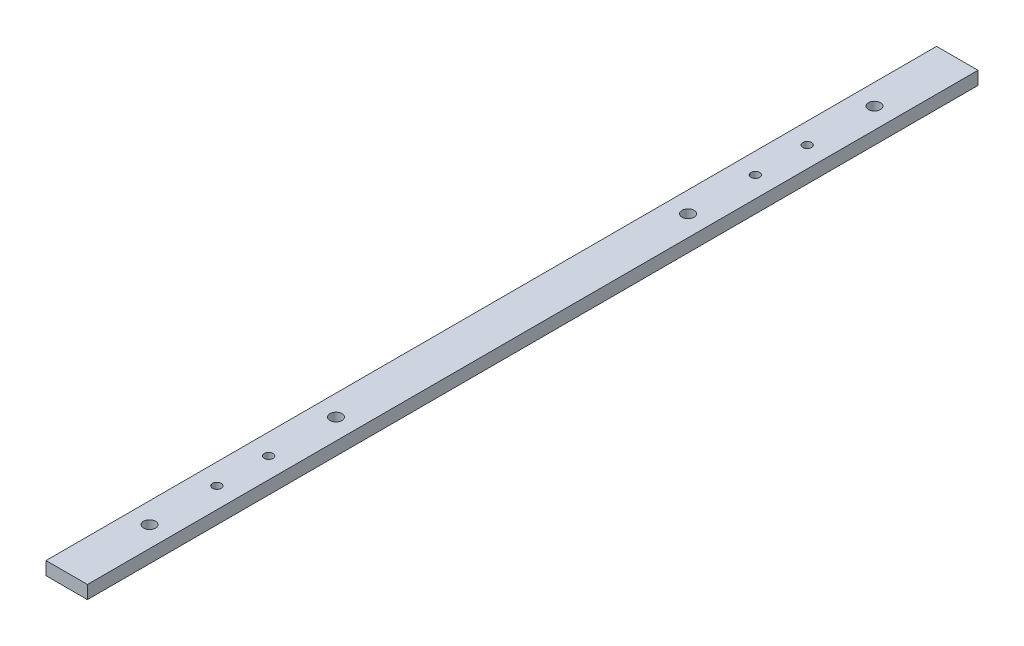
ISO-10303-21;
HEADER;
FILE_DESCRIPTION(('STEP AP214'),'2;1');
FILE_NAME('part.step','',(''),(''),'','','');
FILE_SCHEMA(('AUTOMOTIVE_DESIGN { 1 0 10303 214 1 1 1 1 }'));
ENDSEC;
DATA;
#1=APPLICATION_CONTEXT('core data for automotive mechanical design processes');
#2=APPLICATION_PROTOCOL_DEFINITION('international standard','automotive_design',2000,#1);
#3=PRODUCT_CONTEXT('',#1,'mechanical');
#4=PRODUCT('Part','Part','',(#3));
#5=PRODUCT_RELATED_PRODUCT_CATEGORY('part','',(#4));
#6=PRODUCT_DEFINITION_FORMATION('','',#4);
#7=PRODUCT_DEFINITION_CONTEXT('part definition',#1,'design');
#8=PRODUCT_DEFINITION('design','',#6,#7);
#9=PRODUCT_DEFINITION_SHAPE('','',#8);
#10=(LENGTH_UNIT() NAMED_UNIT(*) SI_UNIT(.MILLI.,.METRE.));
#11=(NAMED_UNIT(*) PLANE_ANGLE_UNIT() SI_UNIT($,.RADIAN.));
#12=(NAMED_UNIT(*) SI_UNIT($,.STERADIAN.) SOLID_ANGLE_UNIT());
#13=UNCERTAINTY_MEASURE_WITH_UNIT(LENGTH_MEASURE(1.E-05),#10,'distance_accuracy_value','');
#14=(GEOMETRIC_REPRESENTATION_CONTEXT(3) GLOBAL_UNCERTAINTY_ASSIGNED_CONTEXT((#13)) GLOBAL_UNIT_ASSIGNED_CONTEXT((#10,
#11,#12)) REPRESENTATION_CONTEXT('',''));
#15=CARTESIAN_POINT('',(0.,0.,0.));
#16=DIRECTION('',(0.,0.,1.));
#17=DIRECTION('',(1.,0.,0.));
#18=AXIS2_PLACEMENT_3D('',#15,#16,#17);
#19=CARTESIAN_POINT('',(10.,6.35,215.));
#20=DIRECTION('',(-1.,0.,0.));
#21=DIRECTION('',(0.,0.,1.));
#22=AXIS2_PLACEMENT_3D('',#19,#20,#21);
#23=PLANE('',#22);
#24=DIRECTION('',(0.,0.,-1.));
#25=VECTOR('',#24,1.);
#26=CARTESIAN_POINT('',(10.,0.,215.));
#27=LINE('',#26,#25);
#28=CARTESIAN_POINT('',(10.,0.,215.));
#29=VERTEX_POINT('',#28);
#30=CARTESIAN_POINT('',(10.,0.,-215.));
#31=VERTEX_POINT('',#30);
#32=EDGE_CURVE('E97',#29,#31,#27,.T.);
#33=ORIENTED_EDGE('',*,*,#32,.T.);
#34=DIRECTION('',(0.,-1.,0.));
#35=VECTOR('',#34,1.);
#36=CARTESIAN_POINT('',(10.,6.35,-215.));
#37=LINE('',#36,#35);
#38=CARTESIAN_POINT('',(10.,6.35,-215.));
#39=VERTEX_POINT('',#38);
#40=EDGE_CURVE('E11',#39,#31,#37,.T.);
#41=ORIENTED_EDGE('',*,*,#40,.F.);
#42=DIRECTION('',(0.,0.,-1.));
#43=VECTOR('',#42,1.);
#44=CARTESIAN_POINT('',(10.,6.35,215.));
#45=LINE('',#44,#43);
#46=CARTESIAN_POINT('',(10.,6.35,215.));
#47=VERTEX_POINT('',#46);
#48=EDGE_CURVE('E85',#47,#39,#45,.T.);
#49=ORIENTED_EDGE('',*,*,#48,.F.);
#50=DIRECTION('',(0.,-1.,0.));
#51=VECTOR('',#50,1.);
#52=CARTESIAN_POINT('',(10.,6.35,215.));
#53=LINE('',#52,#51);
#54=EDGE_CURVE('E93',#47,#29,#53,.T.);
#55=ORIENTED_EDGE('',*,*,#54,.T.);
#56=EDGE_LOOP('',(#33,#41,#49,#55));
#57=FACE_BOUND('',#56,.T.);
#58=ADVANCED_FACE('F34',(#57),#23,.F.);
#59=CARTESIAN_POINT('',(-10.,6.35,-215.));
#60=DIRECTION('',(0.,0.,1.));
#61=DIRECTION('',(1.,0.,0.));
#62=AXIS2_PLACEMENT_3D('',#59,#60,#61);
#63=PLANE('',#62);
#64=DIRECTION('',(-1.,0.,0.));
#65=VECTOR('',#64,1.);
#66=CARTESIAN_POINT('',(-10.,0.,-215.));
#67=LINE('',#66,#65);
#68=CARTESIAN_POINT('',(-10.,0.,-215.));
#69=VERTEX_POINT('',#68);
#70=EDGE_CURVE('E89',#31,#69,#67,.T.);
#71=ORIENTED_EDGE('',*,*,#70,.T.);
#72=DIRECTION('',(0.,-1.,0.));
#73=VECTOR('',#72,1.);
#74=CARTESIAN_POINT('',(-10.,6.35,-215.));
#75=LINE('',#74,#73);
#76=CARTESIAN_POINT('',(-10.,6.35,-215.));
#77=VERTEX_POINT('',#76);
#78=EDGE_CURVE('E42',#77,#69,#75,.T.);
#79=ORIENTED_EDGE('',*,*,#78,.F.);
#80=DIRECTION('',(-1.,0.,0.));
#81=VECTOR('',#80,1.);
#82=CARTESIAN_POINT('',(-10.,6.35,-215.));
#83=LINE('',#82,#81);
#84=EDGE_CURVE('E80',#39,#77,#83,.T.);
#85=ORIENTED_EDGE('',*,*,#84,.F.);
#86=ORIENTED_EDGE('',*,*,#40,.T.);
#87=EDGE_LOOP('',(#71,#79,#85,#86));
#88=FACE_BOUND('',#87,.T.);
#89=ADVANCED_FACE('F88',(#88),#63,.F.);
#90=CARTESIAN_POINT('',(-10.,6.35,215.));
#91=DIRECTION('',(1.,0.,0.));
#92=DIRECTION('',(0.,0.,-1.));
#93=AXIS2_PLACEMENT_3D('',#90,#91,#92);
#94=PLANE('',#93);
#95=DIRECTION('',(0.,0.,1.));
#96=VECTOR('',#95,1.);
#97=CARTESIAN_POINT('',(-10.,0.,215.));
#98=LINE('',#97,#96);
#99=CARTESIAN_POINT('',(-10.,0.,215.));
#100=VERTEX_POINT('',#99);
#101=EDGE_CURVE('E67',#69,#100,#98,.T.);
#102=ORIENTED_EDGE('',*,*,#101,.T.);
#103=DIRECTION('',(0.,-1.,0.));
#104=VECTOR('',#103,1.);
#105=CARTESIAN_POINT('',(-10.,6.35,215.));
#106=LINE('',#105,#104);
#107=CARTESIAN_POINT('',(-10.,6.35,215.));
#108=VERTEX_POINT('',#107);
#109=EDGE_CURVE('E90',#108,#100,#106,.T.);
#110=ORIENTED_EDGE('',*,*,#109,.F.);
#111=DIRECTION('',(0.,0.,1.));
#112=VECTOR('',#111,1.);
#113=CARTESIAN_POINT('',(-10.,6.35,215.));
#114=LINE('',#113,#112);
#115=EDGE_CURVE('E83',#77,#108,#114,.T.);
#116=ORIENTED_EDGE('',*,*,#115,.F.);
#117=ORIENTED_EDGE('',*,*,#78,.T.);
#118=EDGE_LOOP('',(#102,#110,#116,#117));
#119=FACE_BOUND('',#118,.T.);
#120=ADVANCED_FACE('F91',(#119),#94,.F.);
#121=CARTESIAN_POINT('',(-10.,6.35,215.));
#122=DIRECTION('',(0.,0.,-1.));
#123=DIRECTION('',(-1.,0.,0.));
#124=AXIS2_PLACEMENT_3D('',#121,#122,#123);
#125=PLANE('',#124);
#126=DIRECTION('',(1.,0.,0.));
#127=VECTOR('',#126,1.);
#128=CARTESIAN_POINT('',(-10.,0.,215.));
#129=LINE('',#128,#127);
#130=EDGE_CURVE('E73',#100,#29,#129,.T.);
#131=ORIENTED_EDGE('',*,*,#130,.T.);
#132=ORIENTED_EDGE('',*,*,#54,.F.);
#133=DIRECTION('',(1.,0.,0.));
#134=VECTOR('',#133,1.);
#135=CARTESIAN_POINT('',(-10.,6.35,215.));
#136=LINE('',#135,#134);
#137=EDGE_CURVE('E50',#108,#47,#136,.T.);
#138=ORIENTED_EDGE('',*,*,#137,.F.);
#139=ORIENTED_EDGE('',*,*,#109,.T.);
#140=EDGE_LOOP('',(#131,#132,#138,#139));
#141=FACE_BOUND('',#140,.T.);
#142=ADVANCED_FACE('F105',(#141),#125,.F.);
#143=CARTESIAN_POINT('',(0.,6.35,0.));
#144=DIRECTION('',(0.,-1.,0.));
#145=DIRECTION('',(0.,0.,-1.));
#146=AXIS2_PLACEMENT_3D('',#143,#144,#145);
#147=PLANE('',#146);
#148=CARTESIAN_POINT('',(0.,6.35,-142.5));
#149=DIRECTION('',(0.,1.,0.));
#150=DIRECTION('',(0.,0.,1.));
#151=AXIS2_PLACEMENT_3D('',#148,#149,#150);
#152=CIRCLE('',#151,2.1);
#153=CARTESIAN_POINT('',(0.,6.35,-140.4));
#154=VERTEX_POINT('',#153);
#155=EDGE_CURVE('E155',#154,#154,#152,.T.);
#156=ORIENTED_EDGE('',*,*,#155,.F.);
#157=EDGE_LOOP('',(#156));
#158=FACE_BOUND('',#157,.T.);
#159=CARTESIAN_POINT('',(0.,6.35,-117.5));
#160=DIRECTION('',(0.,1.,0.));
#161=DIRECTION('',(0.,0.,1.));
#162=AXIS2_PLACEMENT_3D('',#159,#160,#161);
#163=CIRCLE('',#162,2.1);
#164=CARTESIAN_POINT('',(0.,6.35,-115.4));
#165=VERTEX_POINT('',#164);
#166=EDGE_CURVE('E149',#165,#165,#163,.T.);
#167=ORIENTED_EDGE('',*,*,#166,.F.);
#168=EDGE_LOOP('',(#167));
#169=FACE_BOUND('',#168,.T.);
#170=CARTESIAN_POINT('',(0.,6.35,142.5));
#171=DIRECTION('',(0.,1.,0.));
#172=DIRECTION('',(0.,0.,1.));
#173=AXIS2_PLACEMENT_3D('',#170,#171,#172);
#174=CIRCLE('',#173,2.1);
#175=CARTESIAN_POINT('',(0.,6.35,144.6));
#176=VERTEX_POINT('',#175);
#177=EDGE_CURVE('E143',#176,#176,#174,.T.);
#178=ORIENTED_EDGE('',*,*,#177,.F.);
#179=EDGE_LOOP('',(#178));
#180=FACE_BOUND('',#179,.T.);
#181=CARTESIAN_POINT('',(0.,6.35,117.5));
#182=DIRECTION('',(0.,1.,0.));
#183=DIRECTION('',(0.,0.,1.));
#184=AXIS2_PLACEMENT_3D('',#181,#182,#183);
#185=CIRCLE('',#184,2.1);
#186=CARTESIAN_POINT('',(0.,6.35,119.6));
#187=VERTEX_POINT('',#186);
#188=EDGE_CURVE('E137',#187,#187,#185,.T.);
#189=ORIENTED_EDGE('',*,*,#188,.F.);
#190=EDGE_LOOP('',(#189));
#191=FACE_BOUND('',#190,.T.);
#192=CARTESIAN_POINT('',(0.,6.35,-175.));
#193=DIRECTION('',(0.,1.,0.));
#194=DIRECTION('',(0.,0.,1.));
#195=AXIS2_PLACEMENT_3D('',#192,#193,#194);
#196=CIRCLE('',#195,2.89999999999999);
#197=CARTESIAN_POINT('',(0.,6.35,-172.1));
#198=VERTEX_POINT('',#197);
#199=EDGE_CURVE('E131',#198,#198,#196,.T.);
#200=ORIENTED_EDGE('',*,*,#199,.F.);
#201=EDGE_LOOP('',(#200));
#202=FACE_BOUND('',#201,.T.);
#203=CARTESIAN_POINT('',(0.,6.35,-85.));
#204=DIRECTION('',(0.,1.,0.));
#205=DIRECTION('',(0.,0.,1.));
#206=AXIS2_PLACEMENT_3D('',#203,#204,#205);
#207=CIRCLE('',#206,2.89999999999999);
#208=CARTESIAN_POINT('',(0.,6.35,-82.1));
#209=VERTEX_POINT('',#208);
#210=EDGE_CURVE('E125',#209,#209,#207,.T.);
#211=ORIENTED_EDGE('',*,*,#210,.F.);
#212=EDGE_LOOP('',(#211));
#213=FACE_BOUND('',#212,.T.);
#214=CARTESIAN_POINT('',(0.,6.35,175.));
#215=DIRECTION('',(0.,1.,0.));
#216=DIRECTION('',(0.,0.,1.));
#217=AXIS2_PLACEMENT_3D('',#214,#215,#216);
#218=CIRCLE('',#217,2.89999999999999);
#219=CARTESIAN_POINT('',(0.,6.35,177.9));
#220=VERTEX_POINT('',#219);
#221=EDGE_CURVE('E119',#220,#220,#218,.T.);
#222=ORIENTED_EDGE('',*,*,#221,.F.);
#223=EDGE_LOOP('',(#222));
#224=FACE_BOUND('',#223,.T.);
#225=CARTESIAN_POINT('',(0.,6.35,85.));
#226=DIRECTION('',(0.,1.,0.));
#227=DIRECTION('',(0.,0.,1.));
#228=AXIS2_PLACEMENT_3D('',#225,#226,#227);
#229=CIRCLE('',#228,2.89999999999999);
#230=CARTESIAN_POINT('',(0.,6.35,87.9));
#231=VERTEX_POINT('',#230);
#232=EDGE_CURVE('E113',#231,#231,#229,.T.);
#233=ORIENTED_EDGE('',*,*,#232,.F.);
#234=EDGE_LOOP('',(#233));
#235=FACE_BOUND('',#234,.T.);
#236=ORIENTED_EDGE('',*,*,#48,.T.);
#237=ORIENTED_EDGE('',*,*,#84,.T.);
#238=ORIENTED_EDGE('',*,*,#115,.T.);
#239=ORIENTED_EDGE('',*,*,#137,.T.);
#240=EDGE_LOOP('',(#236,#237,#238,#239));
#241=FACE_BOUND('',#240,.T.);
#242=ADVANCED_FACE('F81',(#158,#169,#180,#191,#202,#213,#224,#235,#241),#147,.F.);
#243=CARTESIAN_POINT('',(0.,0.,0.));
#244=DIRECTION('',(0.,-1.,0.));
#245=DIRECTION('',(0.,0.,-1.));
#246=AXIS2_PLACEMENT_3D('',#243,#244,#245);
#247=PLANE('',#246);
#248=CARTESIAN_POINT('',(0.,0.,-142.5));
#249=DIRECTION('',(0.,1.,0.));
#250=DIRECTION('',(0.,0.,1.));
#251=AXIS2_PLACEMENT_3D('',#248,#249,#250);
#252=CIRCLE('',#251,2.1);
#253=CARTESIAN_POINT('',(0.,0.,-140.4));
#254=VERTEX_POINT('',#253);
#255=EDGE_CURVE('E152',#254,#254,#252,.T.);
#256=ORIENTED_EDGE('',*,*,#255,.T.);
#257=EDGE_LOOP('',(#256));
#258=FACE_BOUND('',#257,.T.);
#259=CARTESIAN_POINT('',(0.,0.,-117.5));
#260=DIRECTION('',(0.,1.,0.));
#261=DIRECTION('',(0.,0.,1.));
#262=AXIS2_PLACEMENT_3D('',#259,#260,#261);
#263=CIRCLE('',#262,2.1);
#264=CARTESIAN_POINT('',(0.,0.,-115.4));
#265=VERTEX_POINT('',#264);
#266=EDGE_CURVE('E146',#265,#265,#263,.T.);
#267=ORIENTED_EDGE('',*,*,#266,.T.);
#268=EDGE_LOOP('',(#267));
#269=FACE_BOUND('',#268,.T.);
#270=CARTESIAN_POINT('',(0.,0.,142.5));
#271=DIRECTION('',(0.,1.,0.));
#272=DIRECTION('',(0.,0.,1.));
#273=AXIS2_PLACEMENT_3D('',#270,#271,#272);
#274=CIRCLE('',#273,2.1);
#275=CARTESIAN_POINT('',(0.,0.,144.6));
#276=VERTEX_POINT('',#275);
#277=EDGE_CURVE('E140',#276,#276,#274,.T.);
#278=ORIENTED_EDGE('',*,*,#277,.T.);
#279=EDGE_LOOP('',(#278));
#280=FACE_BOUND('',#279,.T.);
#281=CARTESIAN_POINT('',(0.,0.,117.5));
#282=DIRECTION('',(0.,1.,0.));
#283=DIRECTION('',(0.,0.,1.));
#284=AXIS2_PLACEMENT_3D('',#281,#282,#283);
#285=CIRCLE('',#284,2.1);
#286=CARTESIAN_POINT('',(0.,0.,119.6));
#287=VERTEX_POINT('',#286);
#288=EDGE_CURVE('E134',#287,#287,#285,.T.);
#289=ORIENTED_EDGE('',*,*,#288,.T.);
#290=EDGE_LOOP('',(#289));
#291=FACE_BOUND('',#290,.T.);
#292=CARTESIAN_POINT('',(0.,0.,-175.));
#293=DIRECTION('',(0.,1.,0.));
#294=DIRECTION('',(0.,0.,1.));
#295=AXIS2_PLACEMENT_3D('',#292,#293,#294);
#296=CIRCLE('',#295,2.9);
#297=CARTESIAN_POINT('',(0.,0.,-172.1));
#298=VERTEX_POINT('',#297);
#299=EDGE_CURVE('E128',#298,#298,#296,.T.);
#300=ORIENTED_EDGE('',*,*,#299,.T.);
#301=EDGE_LOOP('',(#300));
#302=FACE_BOUND('',#301,.T.);
#303=CARTESIAN_POINT('',(0.,0.,-85.));
#304=DIRECTION('',(0.,1.,0.));
#305=DIRECTION('',(0.,0.,1.));
#306=AXIS2_PLACEMENT_3D('',#303,#304,#305);
#307=CIRCLE('',#306,2.9);
#308=CARTESIAN_POINT('',(0.,0.,-82.1));
#309=VERTEX_POINT('',#308);
#310=EDGE_CURVE('E122',#309,#309,#307,.T.);
#311=ORIENTED_EDGE('',*,*,#310,.T.);
#312=EDGE_LOOP('',(#311));
#313=FACE_BOUND('',#312,.T.);
#314=CARTESIAN_POINT('',(0.,0.,175.));
#315=DIRECTION('',(0.,1.,0.));
#316=DIRECTION('',(0.,0.,1.));
#317=AXIS2_PLACEMENT_3D('',#314,#315,#316);
#318=CIRCLE('',#317,2.9);
#319=CARTESIAN_POINT('',(0.,0.,177.9));
#320=VERTEX_POINT('',#319);
#321=EDGE_CURVE('E116',#320,#320,#318,.T.);
#322=ORIENTED_EDGE('',*,*,#321,.T.);
#323=EDGE_LOOP('',(#322));
#324=FACE_BOUND('',#323,.T.);
#325=CARTESIAN_POINT('',(0.,0.,85.));
#326=DIRECTION('',(0.,1.,0.));
#327=DIRECTION('',(0.,0.,1.));
#328=AXIS2_PLACEMENT_3D('',#325,#326,#327);
#329=CIRCLE('',#328,2.9);
#330=CARTESIAN_POINT('',(0.,0.,87.9));
#331=VERTEX_POINT('',#330);
#332=EDGE_CURVE('E100',#331,#331,#329,.T.);
#333=ORIENTED_EDGE('',*,*,#332,.T.);
#334=EDGE_LOOP('',(#333));
#335=FACE_BOUND('',#334,.T.);
#336=ORIENTED_EDGE('',*,*,#32,.F.);
#337=ORIENTED_EDGE('',*,*,#130,.F.);
#338=ORIENTED_EDGE('',*,*,#101,.F.);
#339=ORIENTED_EDGE('',*,*,#70,.F.);
#340=EDGE_LOOP('',(#336,#337,#338,#339));
#341=FACE_BOUND('',#340,.T.);
#342=ADVANCED_FACE('F108',(#258,#269,#280,#291,#302,#313,#324,#335,#341),#247,.T.);
#343=CARTESIAN_POINT('',(0.,6.35,85.));
#344=DIRECTION('',(0.,1.,0.));
#345=DIRECTION('',(0.,0.,1.));
#346=AXIS2_PLACEMENT_3D('',#343,#344,#345);
#347=CYLINDRICAL_SURFACE('',#346,2.89999999999999);
#348=ORIENTED_EDGE('',*,*,#332,.F.);
#349=EDGE_LOOP('',(#348));
#350=FACE_BOUND('',#349,.T.);
#351=ORIENTED_EDGE('',*,*,#232,.T.);
#352=EDGE_LOOP('',(#351));
#353=FACE_BOUND('',#352,.T.);
#354=ADVANCED_FACE('F178',(#350,#353),#347,.F.);
#355=CARTESIAN_POINT('',(0.,6.35,175.));
#356=DIRECTION('',(0.,1.,0.));
#357=DIRECTION('',(0.,0.,1.));
#358=AXIS2_PLACEMENT_3D('',#355,#356,#357);
#359=CYLINDRICAL_SURFACE('',#358,2.89999999999999);
#360=ORIENTED_EDGE('',*,*,#321,.F.);
#361=EDGE_LOOP('',(#360));
#362=FACE_BOUND('',#361,.T.);
#363=ORIENTED_EDGE('',*,*,#221,.T.);
#364=EDGE_LOOP('',(#363));
#365=FACE_BOUND('',#364,.T.);
#366=ADVANCED_FACE('F180',(#362,#365),#359,.F.);
#367=CARTESIAN_POINT('',(0.,6.35,-85.));
#368=DIRECTION('',(0.,1.,0.));
#369=DIRECTION('',(0.,0.,1.));
#370=AXIS2_PLACEMENT_3D('',#367,#368,#369);
#371=CYLINDRICAL_SURFACE('',#370,2.89999999999999);
#372=ORIENTED_EDGE('',*,*,#310,.F.);
#373=EDGE_LOOP('',(#372));
#374=FACE_BOUND('',#373,.T.);
#375=ORIENTED_EDGE('',*,*,#210,.T.);
#376=EDGE_LOOP('',(#375));
#377=FACE_BOUND('',#376,.T.);
#378=ADVANCED_FACE('F187',(#374,#377),#371,.F.);
#379=CARTESIAN_POINT('',(0.,6.35,-175.));
#380=DIRECTION('',(0.,1.,0.));
#381=DIRECTION('',(0.,0.,1.));
#382=AXIS2_PLACEMENT_3D('',#379,#380,#381);
#383=CYLINDRICAL_SURFACE('',#382,2.89999999999999);
#384=ORIENTED_EDGE('',*,*,#299,.F.);
#385=EDGE_LOOP('',(#384));
#386=FACE_BOUND('',#385,.T.);
#387=ORIENTED_EDGE('',*,*,#199,.T.);
#388=EDGE_LOOP('',(#387));
#389=FACE_BOUND('',#388,.T.);
#390=ADVANCED_FACE('F251',(#386,#389),#383,.F.);
#391=CARTESIAN_POINT('',(0.,6.35,117.5));
#392=DIRECTION('',(0.,1.,0.));
#393=DIRECTION('',(0.,0.,1.));
#394=AXIS2_PLACEMENT_3D('',#391,#392,#393);
#395=CYLINDRICAL_SURFACE('',#394,2.1);
#396=ORIENTED_EDGE('',*,*,#288,.F.);
#397=EDGE_LOOP('',(#396));
#398=FACE_BOUND('',#397,.T.);
#399=ORIENTED_EDGE('',*,*,#188,.T.);
#400=EDGE_LOOP('',(#399));
#401=FACE_BOUND('',#400,.T.);
#402=ADVANCED_FACE('F246',(#398,#401),#395,.F.);
#403=CARTESIAN_POINT('',(0.,6.35,142.5));
#404=DIRECTION('',(0.,1.,0.));
#405=DIRECTION('',(0.,0.,1.));
#406=AXIS2_PLACEMENT_3D('',#403,#404,#405);
#407=CYLINDRICAL_SURFACE('',#406,2.1);
#408=ORIENTED_EDGE('',*,*,#277,.F.);
#409=EDGE_LOOP('',(#408));
#410=FACE_BOUND('',#409,.T.);
#411=ORIENTED_EDGE('',*,*,#177,.T.);
#412=EDGE_LOOP('',(#411));
#413=FACE_BOUND('',#412,.T.);
#414=ADVANCED_FACE('F228',(#410,#413),#407,.F.);
#415=CARTESIAN_POINT('',(0.,6.35,-117.5));
#416=DIRECTION('',(0.,1.,0.));
#417=DIRECTION('',(0.,0.,1.));
#418=AXIS2_PLACEMENT_3D('',#415,#416,#417);
#419=CYLINDRICAL_SURFACE('',#418,2.1);
#420=ORIENTED_EDGE('',*,*,#266,.F.);
#421=EDGE_LOOP('',(#420));
#422=FACE_BOUND('',#421,.T.);
#423=ORIENTED_EDGE('',*,*,#166,.T.);
#424=EDGE_LOOP('',(#423));
#425=FACE_BOUND('',#424,.T.);
#426=ADVANCED_FACE('F222',(#422,#425),#419,.F.);
#427=CARTESIAN_POINT('',(0.,6.35,-142.5));
#428=DIRECTION('',(0.,1.,0.));
#429=DIRECTION('',(0.,0.,1.));
#430=AXIS2_PLACEMENT_3D('',#427,#428,#429);
#431=CYLINDRICAL_SURFACE('',#430,2.1);
#432=ORIENTED_EDGE('',*,*,#255,.F.);
#433=EDGE_LOOP('',(#432));
#434=FACE_BOUND('',#433,.T.);
#435=ORIENTED_EDGE('',*,*,#155,.T.);
#436=EDGE_LOOP('',(#435));
#437=FACE_BOUND('',#436,.T.);
#438=ADVANCED_FACE('F159',(#434,#437),#431,.F.);
#439=CLOSED_SHELL('',(#58,#89,#120,#142,#242,#342,#354,#366,#378,#390,#402,#414,#426,#438));
#440=MANIFOLD_SOLID_BREP('B2',#439);
#441=ADVANCED_BREP_SHAPE_REPRESENTATION('',(#18,#440),#14);
#442=SHAPE_DEFINITION_REPRESENTATION(#9,#441);
ENDSEC;
END-ISO-10303-21;
